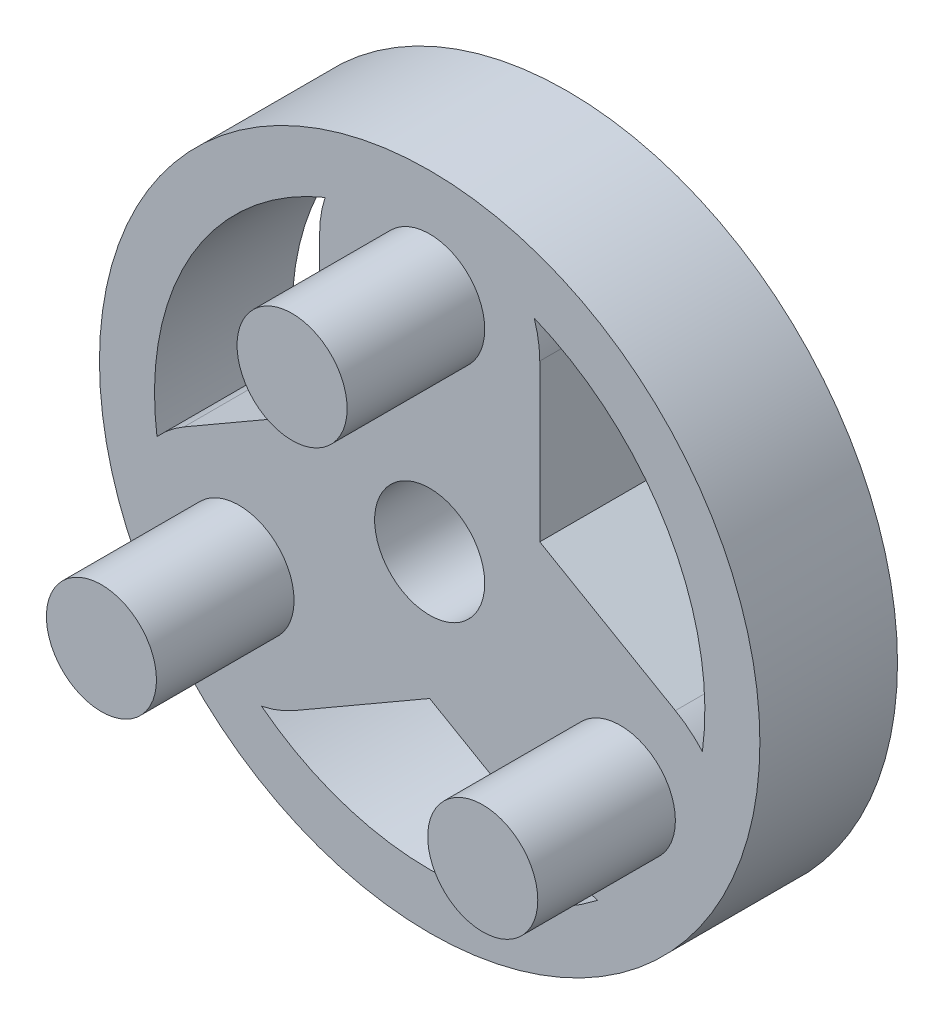
ISO-10303-21;
HEADER;
FILE_DESCRIPTION(('STEP AP214'),'2;1');
FILE_NAME('part.step','',(''),(''),'','','');
FILE_SCHEMA(('AUTOMOTIVE_DESIGN { 1 0 10303 214 1 1 1 1 }'));
ENDSEC;
DATA;
#1=APPLICATION_CONTEXT('core data for automotive mechanical design processes');
#2=APPLICATION_PROTOCOL_DEFINITION('international standard','automotive_design',2000,#1);
#3=PRODUCT_CONTEXT('',#1,'mechanical');
#4=PRODUCT('Part','Part','',(#3));
#5=PRODUCT_RELATED_PRODUCT_CATEGORY('part','',(#4));
#6=PRODUCT_DEFINITION_FORMATION('','',#4);
#7=PRODUCT_DEFINITION_CONTEXT('part definition',#1,'design');
#8=PRODUCT_DEFINITION('design','',#6,#7);
#9=PRODUCT_DEFINITION_SHAPE('','',#8);
#10=(LENGTH_UNIT() NAMED_UNIT(*) SI_UNIT(.MILLI.,.METRE.));
#11=(NAMED_UNIT(*) PLANE_ANGLE_UNIT() SI_UNIT($,.RADIAN.));
#12=(NAMED_UNIT(*) SI_UNIT($,.STERADIAN.) SOLID_ANGLE_UNIT());
#13=UNCERTAINTY_MEASURE_WITH_UNIT(LENGTH_MEASURE(1.E-05),#10,'distance_accuracy_value','');
#14=(GEOMETRIC_REPRESENTATION_CONTEXT(3) GLOBAL_UNCERTAINTY_ASSIGNED_CONTEXT((#13)) GLOBAL_UNIT_ASSIGNED_CONTEXT((#10,
#11,#12)) REPRESENTATION_CONTEXT('',''));
#15=CARTESIAN_POINT('',(0.,0.,0.));
#16=DIRECTION('',(0.,0.,1.));
#17=DIRECTION('',(1.,0.,0.));
#18=AXIS2_PLACEMENT_3D('',#15,#16,#17);
#19=CARTESIAN_POINT('',(0.,8.,5.));
#20=DIRECTION('',(0.,0.,-1.));
#21=DIRECTION('',(-1.,0.,0.));
#22=AXIS2_PLACEMENT_3D('',#19,#20,#21);
#23=CYLINDRICAL_SURFACE('',#22,4.);
#24=DIRECTION('',(0.,0.,1.));
#25=VECTOR('',#24,1.);
#26=CARTESIAN_POINT('',(-3.79967103839267,9.25,2.5));
#27=LINE('',#26,#25);
#28=CARTESIAN_POINT('',(-3.79967103839267,9.25,0.));
#29=VERTEX_POINT('',#28);
#30=CARTESIAN_POINT('',(-3.79967103839267,9.25,5.));
#31=VERTEX_POINT('',#30);
#32=EDGE_CURVE('E195',#29,#31,#27,.T.);
#33=ORIENTED_EDGE('',*,*,#32,.F.);
#34=CARTESIAN_POINT('',(0.,8.,0.));
#35=DIRECTION('',(0.,0.,1.));
#36=DIRECTION('',(1.,0.,0.));
#37=AXIS2_PLACEMENT_3D('',#34,#35,#36);
#38=CIRCLE('',#37,4.);
#39=CARTESIAN_POINT('',(-4.,8.,0.));
#40=VERTEX_POINT('',#39);
#41=EDGE_CURVE('E228',#29,#40,#38,.T.);
#42=ORIENTED_EDGE('',*,*,#41,.T.);
#43=DIRECTION('',(0.,0.,-1.));
#44=VECTOR('',#43,1.);
#45=CARTESIAN_POINT('',(-4.,8.,5.));
#46=LINE('',#45,#44);
#47=CARTESIAN_POINT('',(-4.,8.,5.));
#48=VERTEX_POINT('',#47);
#49=EDGE_CURVE('E11',#48,#40,#46,.T.);
#50=ORIENTED_EDGE('',*,*,#49,.F.);
#51=CARTESIAN_POINT('',(0.,8.,5.));
#52=DIRECTION('',(0.,0.,1.));
#53=DIRECTION('',(1.,0.,0.));
#54=AXIS2_PLACEMENT_3D('',#51,#52,#53);
#55=CIRCLE('',#54,4.);
#56=EDGE_CURVE('E200',#31,#48,#55,.T.);
#57=ORIENTED_EDGE('',*,*,#56,.F.);
#58=EDGE_LOOP('',(#33,#42,#50,#57));
#59=FACE_BOUND('',#58,.T.);
#60=ADVANCED_FACE('F35',(#59),#23,.T.);
#61=DIRECTION('',(0.,0.,1.));
#62=VECTOR('',#61,1.);
#63=CARTESIAN_POINT('',(3.79967103839267,9.25,2.5));
#64=LINE('',#63,#62);
#65=CARTESIAN_POINT('',(3.79967103839267,9.25,5.));
#66=VERTEX_POINT('',#65);
#67=CARTESIAN_POINT('',(3.79967103839267,9.25,0.));
#68=VERTEX_POINT('',#67);
#69=EDGE_CURVE('E164',#66,#68,#64,.F.);
#70=ORIENTED_EDGE('',*,*,#69,.F.);
#71=CARTESIAN_POINT('',(4.,8.,5.));
#72=VERTEX_POINT('',#71);
#73=EDGE_CURVE('E299',#72,#66,#55,.T.);
#74=ORIENTED_EDGE('',*,*,#73,.F.);
#75=DIRECTION('',(0.,0.,-1.));
#76=VECTOR('',#75,1.);
#77=CARTESIAN_POINT('',(4.,8.,5.));
#78=LINE('',#77,#76);
#79=CARTESIAN_POINT('',(4.,8.,0.));
#80=VERTEX_POINT('',#79);
#81=EDGE_CURVE('E224',#72,#80,#78,.T.);
#82=ORIENTED_EDGE('',*,*,#81,.T.);
#83=EDGE_CURVE('E225',#80,#68,#38,.T.);
#84=ORIENTED_EDGE('',*,*,#83,.T.);
#85=EDGE_LOOP('',(#70,#74,#82,#84));
#86=FACE_BOUND('',#85,.T.);
#87=ADVANCED_FACE('F306',(#86),#23,.T.);
#88=CARTESIAN_POINT('',(-6.92820323027555,-3.99999999999993,5.));
#89=DIRECTION('',(0.,0.,-1.));
#90=DIRECTION('',(-1.,0.,0.));
#91=AXIS2_PLACEMENT_3D('',#88,#89,#90);
#92=CYLINDRICAL_SURFACE('',#91,4.);
#93=DIRECTION('',(0.,0.,1.));
#94=VECTOR('',#93,1.);
#95=CARTESIAN_POINT('',(-6.1108994658098,-7.91561164527199,2.5));
#96=LINE('',#95,#94);
#97=CARTESIAN_POINT('',(-6.1108994658098,-7.91561164527199,0.));
#98=VERTEX_POINT('',#97);
#99=CARTESIAN_POINT('',(-6.1108994658098,-7.91561164527199,5.));
#100=VERTEX_POINT('',#99);
#101=EDGE_CURVE('E269',#98,#100,#96,.T.);
#102=ORIENTED_EDGE('',*,*,#101,.F.);
#103=CARTESIAN_POINT('',(-6.92820323027555,-3.99999999999993,0.));
#104=DIRECTION('',(0.,0.,1.));
#105=DIRECTION('',(1.,0.,0.));
#106=AXIS2_PLACEMENT_3D('',#103,#104,#105);
#107=CIRCLE('',#106,4.);
#108=CARTESIAN_POINT('',(-4.92820323027558,-7.46410161513771,0.));
#109=VERTEX_POINT('',#108);
#110=EDGE_CURVE('E232',#98,#109,#107,.T.);
#111=ORIENTED_EDGE('',*,*,#110,.T.);
#112=DIRECTION('',(0.,0.,-1.));
#113=VECTOR('',#112,1.);
#114=CARTESIAN_POINT('',(-4.92820323027558,-7.46410161513771,5.));
#115=LINE('',#114,#113);
#116=CARTESIAN_POINT('',(-4.92820323027558,-7.46410161513771,5.));
#117=VERTEX_POINT('',#116);
#118=EDGE_CURVE('E254',#117,#109,#115,.T.);
#119=ORIENTED_EDGE('',*,*,#118,.F.);
#120=CARTESIAN_POINT('',(-6.92820323027555,-3.99999999999993,5.));
#121=DIRECTION('',(0.,0.,1.));
#122=DIRECTION('',(1.,0.,0.));
#123=AXIS2_PLACEMENT_3D('',#120,#121,#122);
#124=CIRCLE('',#123,4.);
#125=EDGE_CURVE('E210',#100,#117,#124,.T.);
#126=ORIENTED_EDGE('',*,*,#125,.F.);
#127=EDGE_LOOP('',(#102,#111,#119,#126));
#128=FACE_BOUND('',#127,.T.);
#129=ADVANCED_FACE('F310',(#128),#92,.T.);
#130=DIRECTION('',(0.,0.,1.));
#131=VECTOR('',#130,1.);
#132=CARTESIAN_POINT('',(-9.9105705042024,-1.33438835472786,2.5));
#133=LINE('',#132,#131);
#134=CARTESIAN_POINT('',(-9.91057050420241,-1.33438835472786,5.));
#135=VERTEX_POINT('',#134);
#136=CARTESIAN_POINT('',(-9.91057050420241,-1.33438835472786,0.));
#137=VERTEX_POINT('',#136);
#138=EDGE_CURVE('E160',#135,#137,#133,.F.);
#139=ORIENTED_EDGE('',*,*,#138,.F.);
#140=CARTESIAN_POINT('',(-8.92820323027551,-0.53589838486216,5.));
#141=VERTEX_POINT('',#140);
#142=EDGE_CURVE('E203',#141,#135,#124,.T.);
#143=ORIENTED_EDGE('',*,*,#142,.F.);
#144=DIRECTION('',(0.,0.,-1.));
#145=VECTOR('',#144,1.);
#146=CARTESIAN_POINT('',(-8.92820323027551,-0.53589838486216,5.));
#147=LINE('',#146,#145);
#148=CARTESIAN_POINT('',(-8.92820323027551,-0.53589838486216,0.));
#149=VERTEX_POINT('',#148);
#150=EDGE_CURVE('E257',#141,#149,#147,.T.);
#151=ORIENTED_EDGE('',*,*,#150,.T.);
#152=EDGE_CURVE('E233',#149,#137,#107,.T.);
#153=ORIENTED_EDGE('',*,*,#152,.T.);
#154=EDGE_LOOP('',(#139,#143,#151,#153));
#155=FACE_BOUND('',#154,.T.);
#156=ADVANCED_FACE('F268',(#155),#92,.T.);
#157=CARTESIAN_POINT('',(6.92820323027549,-4.00000000000003,5.));
#158=DIRECTION('',(0.,0.,-1.));
#159=DIRECTION('',(-1.,0.,0.));
#160=AXIS2_PLACEMENT_3D('',#157,#158,#159);
#161=CYLINDRICAL_SURFACE('',#160,4.);
#162=DIRECTION('',(0.,0.,1.));
#163=VECTOR('',#162,1.);
#164=CARTESIAN_POINT('',(9.91057050420239,-1.334388354728,2.5));
#165=LINE('',#164,#163);
#166=CARTESIAN_POINT('',(9.91057050420238,-1.334388354728,0.));
#167=VERTEX_POINT('',#166);
#168=CARTESIAN_POINT('',(9.91057050420238,-1.334388354728,5.));
#169=VERTEX_POINT('',#168);
#170=EDGE_CURVE('E155',#167,#169,#165,.T.);
#171=ORIENTED_EDGE('',*,*,#170,.F.);
#172=CARTESIAN_POINT('',(6.92820323027549,-4.00000000000003,0.));
#173=DIRECTION('',(0.,0.,1.));
#174=DIRECTION('',(1.,0.,0.));
#175=AXIS2_PLACEMENT_3D('',#172,#173,#174);
#176=CIRCLE('',#175,4.);
#177=CARTESIAN_POINT('',(8.92820323027551,-0.535898384862288,0.));
#178=VERTEX_POINT('',#177);
#179=EDGE_CURVE('E143',#167,#178,#176,.T.);
#180=ORIENTED_EDGE('',*,*,#179,.T.);
#181=DIRECTION('',(0.,0.,-1.));
#182=VECTOR('',#181,1.);
#183=CARTESIAN_POINT('',(8.92820323027551,-0.535898384862288,5.));
#184=LINE('',#183,#182);
#185=CARTESIAN_POINT('',(8.92820323027551,-0.535898384862288,5.));
#186=VERTEX_POINT('',#185);
#187=EDGE_CURVE('E246',#186,#178,#184,.T.);
#188=ORIENTED_EDGE('',*,*,#187,.F.);
#189=CARTESIAN_POINT('',(6.92820323027549,-4.00000000000003,5.));
#190=DIRECTION('',(0.,0.,1.));
#191=DIRECTION('',(1.,0.,0.));
#192=AXIS2_PLACEMENT_3D('',#189,#190,#191);
#193=CIRCLE('',#192,4.);
#194=EDGE_CURVE('E49',#169,#186,#193,.T.);
#195=ORIENTED_EDGE('',*,*,#194,.F.);
#196=EDGE_LOOP('',(#171,#180,#188,#195));
#197=FACE_BOUND('',#196,.T.);
#198=ADVANCED_FACE('F156',(#197),#161,.T.);
#199=DIRECTION('',(0.,0.,1.));
#200=VECTOR('',#199,1.);
#201=CARTESIAN_POINT('',(6.11089946580969,-7.91561164527208,2.5));
#202=LINE('',#201,#200);
#203=CARTESIAN_POINT('',(6.11089946580969,-7.91561164527208,5.));
#204=VERTEX_POINT('',#203);
#205=CARTESIAN_POINT('',(6.11089946580969,-7.91561164527208,0.));
#206=VERTEX_POINT('',#205);
#207=EDGE_CURVE('E57',#204,#206,#202,.F.);
#208=ORIENTED_EDGE('',*,*,#207,.F.);
#209=CARTESIAN_POINT('',(4.92820323027547,-7.46410161513778,5.));
#210=VERTEX_POINT('',#209);
#211=EDGE_CURVE('E218',#210,#204,#193,.T.);
#212=ORIENTED_EDGE('',*,*,#211,.F.);
#213=DIRECTION('',(0.,0.,-1.));
#214=VECTOR('',#213,1.);
#215=CARTESIAN_POINT('',(4.92820323027547,-7.46410161513778,5.));
#216=LINE('',#215,#214);
#217=CARTESIAN_POINT('',(4.92820323027547,-7.46410161513778,0.));
#218=VERTEX_POINT('',#217);
#219=EDGE_CURVE('E248',#210,#218,#216,.T.);
#220=ORIENTED_EDGE('',*,*,#219,.T.);
#221=EDGE_CURVE('E152',#218,#206,#176,.T.);
#222=ORIENTED_EDGE('',*,*,#221,.T.);
#223=EDGE_LOOP('',(#208,#212,#220,#222));
#224=FACE_BOUND('',#223,.T.);
#225=ADVANCED_FACE('F342',(#224),#161,.T.);
#226=CARTESIAN_POINT('',(-4.,2.30940107675853,5.));
#227=DIRECTION('',(1.,0.,0.));
#228=DIRECTION('',(0.,0.,-1.));
#229=AXIS2_PLACEMENT_3D('',#226,#227,#228);
#230=PLANE('',#229);
#231=DIRECTION('',(0.,-1.,0.));
#232=VECTOR('',#231,1.);
#233=CARTESIAN_POINT('',(-4.,2.30940107675853,0.));
#234=LINE('',#233,#232);
#235=CARTESIAN_POINT('',(-4.,2.30940107675853,0.));
#236=VERTEX_POINT('',#235);
#237=EDGE_CURVE('E227',#40,#236,#234,.T.);
#238=ORIENTED_EDGE('',*,*,#237,.T.);
#239=DIRECTION('',(0.,0.,-1.));
#240=VECTOR('',#239,1.);
#241=CARTESIAN_POINT('',(-4.,2.30940107675853,5.));
#242=LINE('',#241,#240);
#243=CARTESIAN_POINT('',(-4.,2.30940107675853,5.));
#244=VERTEX_POINT('',#243);
#245=EDGE_CURVE('E42',#244,#236,#242,.T.);
#246=ORIENTED_EDGE('',*,*,#245,.F.);
#247=DIRECTION('',(0.,-1.,0.));
#248=VECTOR('',#247,1.);
#249=CARTESIAN_POINT('',(-4.,2.30940107675853,5.));
#250=LINE('',#249,#248);
#251=EDGE_CURVE('E301',#48,#244,#250,.T.);
#252=ORIENTED_EDGE('',*,*,#251,.F.);
#253=ORIENTED_EDGE('',*,*,#49,.T.);
#254=EDGE_LOOP('',(#238,#246,#252,#253));
#255=FACE_BOUND('',#254,.T.);
#256=ADVANCED_FACE('F303',(#255),#230,.F.);
#257=CARTESIAN_POINT('',(-4.,2.30940107675853,5.));
#258=DIRECTION('',(0.499999999999991,-0.866025403784444,0.));
#259=DIRECTION('',(0.866025403784444,0.499999999999991,0.));
#260=AXIS2_PLACEMENT_3D('',#257,#258,#259);
#261=PLANE('',#260);
#262=DIRECTION('',(-0.866025403784444,-0.499999999999991,0.));
#263=VECTOR('',#262,1.);
#264=CARTESIAN_POINT('',(-4.,2.30940107675853,0.));
#265=LINE('',#264,#263);
#266=EDGE_CURVE('E230',#236,#149,#265,.T.);
#267=ORIENTED_EDGE('',*,*,#266,.T.);
#268=ORIENTED_EDGE('',*,*,#150,.F.);
#269=DIRECTION('',(-0.866025403784444,-0.499999999999991,0.));
#270=VECTOR('',#269,1.);
#271=CARTESIAN_POINT('',(-4.,2.30940107675853,5.));
#272=LINE('',#271,#270);
#273=EDGE_CURVE('E205',#244,#141,#272,.T.);
#274=ORIENTED_EDGE('',*,*,#273,.F.);
#275=ORIENTED_EDGE('',*,*,#245,.T.);
#276=EDGE_LOOP('',(#267,#268,#274,#275));
#277=FACE_BOUND('',#276,.T.);
#278=ADVANCED_FACE('F262',(#277),#261,.F.);
#279=CARTESIAN_POINT('',(0.,-4.618802153517,5.));
#280=DIRECTION('',(-0.499999999999992,0.866025403784443,0.));
#281=DIRECTION('',(-0.866025403784443,-0.499999999999992,0.));
#282=AXIS2_PLACEMENT_3D('',#279,#280,#281);
#283=PLANE('',#282);
#284=DIRECTION('',(0.866025403784443,0.499999999999992,0.));
#285=VECTOR('',#284,1.);
#286=CARTESIAN_POINT('',(0.,-4.618802153517,0.));
#287=LINE('',#286,#285);
#288=CARTESIAN_POINT('',(0.,-4.618802153517,0.));
#289=VERTEX_POINT('',#288);
#290=EDGE_CURVE('E235',#109,#289,#287,.T.);
#291=ORIENTED_EDGE('',*,*,#290,.T.);
#292=DIRECTION('',(0.,0.,-1.));
#293=VECTOR('',#292,1.);
#294=CARTESIAN_POINT('',(0.,-4.618802153517,5.));
#295=LINE('',#294,#293);
#296=CARTESIAN_POINT('',(0.,-4.618802153517,5.));
#297=VERTEX_POINT('',#296);
#298=EDGE_CURVE('E251',#297,#289,#295,.T.);
#299=ORIENTED_EDGE('',*,*,#298,.F.);
#300=DIRECTION('',(0.866025403784443,0.499999999999992,0.));
#301=VECTOR('',#300,1.);
#302=CARTESIAN_POINT('',(0.,-4.618802153517,5.));
#303=LINE('',#302,#301);
#304=EDGE_CURVE('E209',#117,#297,#303,.T.);
#305=ORIENTED_EDGE('',*,*,#304,.F.);
#306=ORIENTED_EDGE('',*,*,#118,.T.);
#307=EDGE_LOOP('',(#291,#299,#305,#306));
#308=FACE_BOUND('',#307,.T.);
#309=ADVANCED_FACE('F336',(#308),#283,.F.);
#310=CARTESIAN_POINT('',(0.,-4.618802153517,5.));
#311=DIRECTION('',(0.500000000000004,0.866025403784436,0.));
#312=DIRECTION('',(-0.866025403784436,0.500000000000004,0.));
#313=AXIS2_PLACEMENT_3D('',#310,#311,#312);
#314=PLANE('',#313);
#315=DIRECTION('',(0.866025403784436,-0.500000000000004,0.));
#316=VECTOR('',#315,1.);
#317=CARTESIAN_POINT('',(0.,-4.618802153517,0.));
#318=LINE('',#317,#316);
#319=EDGE_CURVE('E153',#289,#218,#318,.T.);
#320=ORIENTED_EDGE('',*,*,#319,.T.);
#321=ORIENTED_EDGE('',*,*,#219,.F.);
#322=DIRECTION('',(0.866025403784436,-0.500000000000004,0.));
#323=VECTOR('',#322,1.);
#324=CARTESIAN_POINT('',(0.,-4.618802153517,5.));
#325=LINE('',#324,#323);
#326=EDGE_CURVE('E212',#297,#210,#325,.T.);
#327=ORIENTED_EDGE('',*,*,#326,.F.);
#328=ORIENTED_EDGE('',*,*,#298,.T.);
#329=EDGE_LOOP('',(#320,#321,#327,#328));
#330=FACE_BOUND('',#329,.T.);
#331=ADVANCED_FACE('F329',(#330),#314,.F.);
#332=CARTESIAN_POINT('',(4.,2.30940107675849,5.));
#333=DIRECTION('',(-0.500000000000004,-0.866025403784436,0.));
#334=DIRECTION('',(0.866025403784436,-0.500000000000004,0.));
#335=AXIS2_PLACEMENT_3D('',#332,#333,#334);
#336=PLANE('',#335);
#337=DIRECTION('',(-0.866025403784436,0.500000000000004,0.));
#338=VECTOR('',#337,1.);
#339=CARTESIAN_POINT('',(4.,2.30940107675849,0.));
#340=LINE('',#339,#338);
#341=CARTESIAN_POINT('',(4.,2.30940107675849,0.));
#342=VERTEX_POINT('',#341);
#343=EDGE_CURVE('E150',#178,#342,#340,.T.);
#344=ORIENTED_EDGE('',*,*,#343,.T.);
#345=DIRECTION('',(0.,0.,-1.));
#346=VECTOR('',#345,1.);
#347=CARTESIAN_POINT('',(4.,2.30940107675849,5.));
#348=LINE('',#347,#346);
#349=CARTESIAN_POINT('',(4.,2.30940107675849,5.));
#350=VERTEX_POINT('',#349);
#351=EDGE_CURVE('E243',#350,#342,#348,.T.);
#352=ORIENTED_EDGE('',*,*,#351,.F.);
#353=DIRECTION('',(-0.866025403784436,0.500000000000004,0.));
#354=VECTOR('',#353,1.);
#355=CARTESIAN_POINT('',(4.,2.30940107675849,5.));
#356=LINE('',#355,#354);
#357=EDGE_CURVE('E220',#186,#350,#356,.T.);
#358=ORIENTED_EDGE('',*,*,#357,.F.);
#359=ORIENTED_EDGE('',*,*,#187,.T.);
#360=EDGE_LOOP('',(#344,#352,#358,#359));
#361=FACE_BOUND('',#360,.T.);
#362=ADVANCED_FACE('F327',(#361),#336,.F.);
#363=CARTESIAN_POINT('',(4.,2.30940107675849,5.));
#364=DIRECTION('',(-1.,0.,0.));
#365=DIRECTION('',(0.,0.,1.));
#366=AXIS2_PLACEMENT_3D('',#363,#364,#365);
#367=PLANE('',#366);
#368=DIRECTION('',(0.,1.,0.));
#369=VECTOR('',#368,1.);
#370=CARTESIAN_POINT('',(4.,2.30940107675849,0.));
#371=LINE('',#370,#369);
#372=EDGE_CURVE('E239',#342,#80,#371,.T.);
#373=ORIENTED_EDGE('',*,*,#372,.T.);
#374=ORIENTED_EDGE('',*,*,#81,.F.);
#375=DIRECTION('',(0.,1.,0.));
#376=VECTOR('',#375,1.);
#377=CARTESIAN_POINT('',(4.,2.30940107675849,5.));
#378=LINE('',#377,#376);
#379=EDGE_CURVE('E222',#350,#72,#378,.T.);
#380=ORIENTED_EDGE('',*,*,#379,.F.);
#381=ORIENTED_EDGE('',*,*,#351,.T.);
#382=EDGE_LOOP('',(#373,#374,#380,#381));
#383=FACE_BOUND('',#382,.T.);
#384=ADVANCED_FACE('F325',(#383),#367,.F.);
#385=CARTESIAN_POINT('',(0.,8.,5.));
#386=DIRECTION('',(0.,0.,1.));
#387=DIRECTION('',(1.,0.,0.));
#388=AXIS2_PLACEMENT_3D('',#385,#386,#387);
#389=PLANE('',#388);
#390=CARTESIAN_POINT('',(0.,0.,5.));
#391=DIRECTION('',(0.,0.,1.));
#392=DIRECTION('',(1.,0.,0.));
#393=AXIS2_PLACEMENT_3D('',#390,#391,#392);
#394=CIRCLE('',#393,12.);
#395=CARTESIAN_POINT('',(12.,0.,5.));
#396=VERTEX_POINT('',#395);
#397=EDGE_CURVE('E166',#396,#396,#394,.T.);
#398=ORIENTED_EDGE('',*,*,#397,.T.);
#399=EDGE_LOOP('',(#398));
#400=FACE_BOUND('',#399,.T.);
#401=CARTESIAN_POINT('',(0.,0.,5.));
#402=DIRECTION('',(0.,0.,1.));
#403=DIRECTION('',(1.,0.,0.));
#404=AXIS2_PLACEMENT_3D('',#401,#402,#403);
#405=CIRCLE('',#404,10.);
#406=EDGE_CURVE('E171',#31,#135,#405,.T.);
#407=ORIENTED_EDGE('',*,*,#406,.F.);
#408=ORIENTED_EDGE('',*,*,#56,.T.);
#409=ORIENTED_EDGE('',*,*,#251,.T.);
#410=ORIENTED_EDGE('',*,*,#273,.T.);
#411=ORIENTED_EDGE('',*,*,#142,.T.);
#412=EDGE_LOOP('',(#407,#408,#409,#410,#411));
#413=FACE_BOUND('',#412,.T.);
#414=EDGE_CURVE('E185',#100,#204,#405,.T.);
#415=ORIENTED_EDGE('',*,*,#414,.F.);
#416=ORIENTED_EDGE('',*,*,#125,.T.);
#417=ORIENTED_EDGE('',*,*,#304,.T.);
#418=ORIENTED_EDGE('',*,*,#326,.T.);
#419=ORIENTED_EDGE('',*,*,#211,.T.);
#420=EDGE_LOOP('',(#415,#416,#417,#418,#419));
#421=FACE_BOUND('',#420,.T.);
#422=CARTESIAN_POINT('',(0.,8.,5.));
#423=DIRECTION('',(0.,0.,1.));
#424=DIRECTION('',(1.,0.,0.));
#425=AXIS2_PLACEMENT_3D('',#422,#423,#424);
#426=CIRCLE('',#425,2.);
#427=CARTESIAN_POINT('',(2.,8.,5.));
#428=VERTEX_POINT('',#427);
#429=EDGE_CURVE('E291',#428,#428,#426,.T.);
#430=ORIENTED_EDGE('',*,*,#429,.F.);
#431=EDGE_LOOP('',(#430));
#432=FACE_BOUND('',#431,.T.);
#433=CARTESIAN_POINT('',(-6.92820323027555,-3.99999999999993,5.));
#434=DIRECTION('',(0.,0.,1.));
#435=DIRECTION('',(1.,0.,0.));
#436=AXIS2_PLACEMENT_3D('',#433,#434,#435);
#437=CIRCLE('',#436,2.);
#438=CARTESIAN_POINT('',(-4.92820323027555,-3.99999999999993,5.));
#439=VERTEX_POINT('',#438);
#440=EDGE_CURVE('E281',#439,#439,#437,.T.);
#441=ORIENTED_EDGE('',*,*,#440,.F.);
#442=EDGE_LOOP('',(#441));
#443=FACE_BOUND('',#442,.T.);
#444=CARTESIAN_POINT('',(6.92820323027549,-4.00000000000003,5.));
#445=DIRECTION('',(0.,0.,1.));
#446=DIRECTION('',(1.,0.,0.));
#447=AXIS2_PLACEMENT_3D('',#444,#445,#446);
#448=CIRCLE('',#447,2.);
#449=CARTESIAN_POINT('',(8.92820323027549,-4.00000000000003,5.));
#450=VERTEX_POINT('',#449);
#451=EDGE_CURVE('E285',#450,#450,#448,.T.);
#452=ORIENTED_EDGE('',*,*,#451,.F.);
#453=EDGE_LOOP('',(#452));
#454=FACE_BOUND('',#453,.T.);
#455=ORIENTED_EDGE('',*,*,#73,.T.);
#456=EDGE_CURVE('E184',#169,#66,#405,.T.);
#457=ORIENTED_EDGE('',*,*,#456,.F.);
#458=ORIENTED_EDGE('',*,*,#194,.T.);
#459=ORIENTED_EDGE('',*,*,#357,.T.);
#460=ORIENTED_EDGE('',*,*,#379,.T.);
#461=EDGE_LOOP('',(#455,#457,#458,#459,#460));
#462=FACE_BOUND('',#461,.T.);
#463=CARTESIAN_POINT('',(0.,0.,5.));
#464=DIRECTION('',(0.,0.,1.));
#465=DIRECTION('',(1.,0.,0.));
#466=AXIS2_PLACEMENT_3D('',#463,#464,#465);
#467=CIRCLE('',#466,2.);
#468=CARTESIAN_POINT('',(2.,0.,5.));
#469=VERTEX_POINT('',#468);
#470=EDGE_CURVE('E278',#469,#469,#467,.T.);
#471=ORIENTED_EDGE('',*,*,#470,.F.);
#472=EDGE_LOOP('',(#471));
#473=FACE_BOUND('',#472,.T.);
#474=ADVANCED_FACE('F198',(#400,#413,#421,#432,#443,#454,#462,#473),#389,.T.);
#475=CARTESIAN_POINT('',(0.,8.,0.));
#476=DIRECTION('',(0.,0.,1.));
#477=DIRECTION('',(1.,0.,0.));
#478=AXIS2_PLACEMENT_3D('',#475,#476,#477);
#479=PLANE('',#478);
#480=CARTESIAN_POINT('',(0.,0.,0.));
#481=DIRECTION('',(0.,0.,1.));
#482=DIRECTION('',(1.,0.,0.));
#483=AXIS2_PLACEMENT_3D('',#480,#481,#482);
#484=CIRCLE('',#483,12.);
#485=CARTESIAN_POINT('',(12.,0.,0.));
#486=VERTEX_POINT('',#485);
#487=EDGE_CURVE('E175',#486,#486,#484,.F.);
#488=ORIENTED_EDGE('',*,*,#487,.T.);
#489=EDGE_LOOP('',(#488));
#490=FACE_BOUND('',#489,.T.);
#491=ORIENTED_EDGE('',*,*,#41,.F.);
#492=CARTESIAN_POINT('',(0.,0.,0.));
#493=DIRECTION('',(0.,0.,1.));
#494=DIRECTION('',(1.,0.,0.));
#495=AXIS2_PLACEMENT_3D('',#492,#493,#494);
#496=CIRCLE('',#495,10.);
#497=EDGE_CURVE('E165',#137,#29,#496,.F.);
#498=ORIENTED_EDGE('',*,*,#497,.F.);
#499=ORIENTED_EDGE('',*,*,#152,.F.);
#500=ORIENTED_EDGE('',*,*,#266,.F.);
#501=ORIENTED_EDGE('',*,*,#237,.F.);
#502=EDGE_LOOP('',(#491,#498,#499,#500,#501));
#503=FACE_BOUND('',#502,.T.);
#504=ORIENTED_EDGE('',*,*,#110,.F.);
#505=EDGE_CURVE('E168',#206,#98,#496,.F.);
#506=ORIENTED_EDGE('',*,*,#505,.F.);
#507=ORIENTED_EDGE('',*,*,#221,.F.);
#508=ORIENTED_EDGE('',*,*,#319,.F.);
#509=ORIENTED_EDGE('',*,*,#290,.F.);
#510=EDGE_LOOP('',(#504,#506,#507,#508,#509));
#511=FACE_BOUND('',#510,.T.);
#512=EDGE_CURVE('E148',#68,#167,#496,.F.);
#513=ORIENTED_EDGE('',*,*,#512,.F.);
#514=ORIENTED_EDGE('',*,*,#83,.F.);
#515=ORIENTED_EDGE('',*,*,#372,.F.);
#516=ORIENTED_EDGE('',*,*,#343,.F.);
#517=ORIENTED_EDGE('',*,*,#179,.F.);
#518=EDGE_LOOP('',(#513,#514,#515,#516,#517));
#519=FACE_BOUND('',#518,.T.);
#520=CARTESIAN_POINT('',(0.,0.,0.));
#521=DIRECTION('',(0.,0.,1.));
#522=DIRECTION('',(1.,0.,0.));
#523=AXIS2_PLACEMENT_3D('',#520,#521,#522);
#524=CIRCLE('',#523,2.);
#525=CARTESIAN_POINT('',(2.,0.,0.));
#526=VERTEX_POINT('',#525);
#527=EDGE_CURVE('E275',#526,#526,#524,.T.);
#528=ORIENTED_EDGE('',*,*,#527,.T.);
#529=EDGE_LOOP('',(#528));
#530=FACE_BOUND('',#529,.T.);
#531=ADVANCED_FACE('F144',(#490,#503,#511,#519,#530),#479,.F.);
#532=CARTESIAN_POINT('',(0.,8.,10.));
#533=DIRECTION('',(0.,0.,-1.));
#534=DIRECTION('',(-1.,0.,0.));
#535=AXIS2_PLACEMENT_3D('',#532,#533,#534);
#536=CYLINDRICAL_SURFACE('',#535,2.);
#537=CARTESIAN_POINT('',(0.,8.,10.));
#538=DIRECTION('',(0.,0.,1.));
#539=DIRECTION('',(1.,0.,0.));
#540=AXIS2_PLACEMENT_3D('',#537,#538,#539);
#541=CIRCLE('',#540,2.);
#542=CARTESIAN_POINT('',(2.,8.,10.));
#543=VERTEX_POINT('',#542);
#544=EDGE_CURVE('E294',#543,#543,#541,.T.);
#545=ORIENTED_EDGE('',*,*,#544,.F.);
#546=EDGE_LOOP('',(#545));
#547=FACE_BOUND('',#546,.T.);
#548=ORIENTED_EDGE('',*,*,#429,.T.);
#549=EDGE_LOOP('',(#548));
#550=FACE_BOUND('',#549,.T.);
#551=ADVANCED_FACE('F425',(#547,#550),#536,.T.);
#552=CARTESIAN_POINT('',(0.,8.,10.));
#553=DIRECTION('',(0.,0.,1.));
#554=DIRECTION('',(1.,0.,0.));
#555=AXIS2_PLACEMENT_3D('',#552,#553,#554);
#556=PLANE('',#555);
#557=ORIENTED_EDGE('',*,*,#544,.T.);
#558=EDGE_LOOP('',(#557));
#559=FACE_BOUND('',#558,.T.);
#560=ADVANCED_FACE('F420',(#559),#556,.T.);
#561=CARTESIAN_POINT('',(6.92820323027549,-4.00000000000003,10.));
#562=DIRECTION('',(0.,0.,-1.));
#563=DIRECTION('',(-1.,0.,0.));
#564=AXIS2_PLACEMENT_3D('',#561,#562,#563);
#565=CYLINDRICAL_SURFACE('',#564,2.);
#566=CARTESIAN_POINT('',(6.92820323027549,-4.00000000000003,10.));
#567=DIRECTION('',(0.,0.,1.));
#568=DIRECTION('',(1.,0.,0.));
#569=AXIS2_PLACEMENT_3D('',#566,#567,#568);
#570=CIRCLE('',#569,2.);
#571=CARTESIAN_POINT('',(8.92820323027549,-4.00000000000003,10.));
#572=VERTEX_POINT('',#571);
#573=EDGE_CURVE('E288',#572,#572,#570,.T.);
#574=ORIENTED_EDGE('',*,*,#573,.F.);
#575=EDGE_LOOP('',(#574));
#576=FACE_BOUND('',#575,.T.);
#577=ORIENTED_EDGE('',*,*,#451,.T.);
#578=EDGE_LOOP('',(#577));
#579=FACE_BOUND('',#578,.T.);
#580=ADVANCED_FACE('F412',(#576,#579),#565,.T.);
#581=CARTESIAN_POINT('',(6.92820323027549,-4.00000000000003,10.));
#582=DIRECTION('',(0.,0.,1.));
#583=DIRECTION('',(1.,0.,0.));
#584=AXIS2_PLACEMENT_3D('',#581,#582,#583);
#585=PLANE('',#584);
#586=ORIENTED_EDGE('',*,*,#573,.T.);
#587=EDGE_LOOP('',(#586));
#588=FACE_BOUND('',#587,.T.);
#589=ADVANCED_FACE('F407',(#588),#585,.T.);
#590=CARTESIAN_POINT('',(-6.92820323027555,-3.99999999999993,10.));
#591=DIRECTION('',(0.,0.,-1.));
#592=DIRECTION('',(-1.,0.,0.));
#593=AXIS2_PLACEMENT_3D('',#590,#591,#592);
#594=CYLINDRICAL_SURFACE('',#593,2.);
#595=CARTESIAN_POINT('',(-6.92820323027555,-3.99999999999993,10.));
#596=DIRECTION('',(0.,0.,1.));
#597=DIRECTION('',(1.,0.,0.));
#598=AXIS2_PLACEMENT_3D('',#595,#596,#597);
#599=CIRCLE('',#598,2.);
#600=CARTESIAN_POINT('',(-4.92820323027555,-3.99999999999993,10.));
#601=VERTEX_POINT('',#600);
#602=EDGE_CURVE('E282',#601,#601,#599,.T.);
#603=ORIENTED_EDGE('',*,*,#602,.F.);
#604=EDGE_LOOP('',(#603));
#605=FACE_BOUND('',#604,.T.);
#606=ORIENTED_EDGE('',*,*,#440,.T.);
#607=EDGE_LOOP('',(#606));
#608=FACE_BOUND('',#607,.T.);
#609=ADVANCED_FACE('F399',(#605,#608),#594,.T.);
#610=CARTESIAN_POINT('',(-6.92820323027555,-3.99999999999993,10.));
#611=DIRECTION('',(0.,0.,1.));
#612=DIRECTION('',(1.,0.,0.));
#613=AXIS2_PLACEMENT_3D('',#610,#611,#612);
#614=PLANE('',#613);
#615=ORIENTED_EDGE('',*,*,#602,.T.);
#616=EDGE_LOOP('',(#615));
#617=FACE_BOUND('',#616,.T.);
#618=ADVANCED_FACE('F388',(#617),#614,.T.);
#619=CARTESIAN_POINT('',(0.,0.,0.));
#620=DIRECTION('',(0.,0.,1.));
#621=DIRECTION('',(1.,0.,0.));
#622=AXIS2_PLACEMENT_3D('',#619,#620,#621);
#623=CYLINDRICAL_SURFACE('',#622,2.);
#624=ORIENTED_EDGE('',*,*,#470,.T.);
#625=EDGE_LOOP('',(#624));
#626=FACE_BOUND('',#625,.T.);
#627=ORIENTED_EDGE('',*,*,#527,.F.);
#628=EDGE_LOOP('',(#627));
#629=FACE_BOUND('',#628,.T.);
#630=ADVANCED_FACE('F382',(#626,#629),#623,.F.);
#631=CARTESIAN_POINT('',(0.,0.,-33.9411254969543));
#632=DIRECTION('',(0.,0.,1.));
#633=DIRECTION('',(1.,0.,0.));
#634=AXIS2_PLACEMENT_3D('',#631,#632,#633);
#635=CYLINDRICAL_SURFACE('',#634,12.);
#636=ORIENTED_EDGE('',*,*,#397,.F.);
#637=EDGE_LOOP('',(#636));
#638=FACE_BOUND('',#637,.T.);
#639=ORIENTED_EDGE('',*,*,#487,.F.);
#640=EDGE_LOOP('',(#639));
#641=FACE_BOUND('',#640,.T.);
#642=ADVANCED_FACE('F387',(#638,#641),#635,.T.);
#643=CARTESIAN_POINT('',(0.,0.,-33.9411254969543));
#644=DIRECTION('',(0.,0.,1.));
#645=DIRECTION('',(1.,0.,0.));
#646=AXIS2_PLACEMENT_3D('',#643,#644,#645);
#647=CYLINDRICAL_SURFACE('',#646,10.);
#648=ORIENTED_EDGE('',*,*,#497,.T.);
#649=ORIENTED_EDGE('',*,*,#32,.T.);
#650=ORIENTED_EDGE('',*,*,#406,.T.);
#651=ORIENTED_EDGE('',*,*,#138,.T.);
#652=EDGE_LOOP('',(#648,#649,#650,#651));
#653=FACE_BOUND('',#652,.T.);
#654=ADVANCED_FACE('F192',(#653),#647,.F.);
#655=ORIENTED_EDGE('',*,*,#456,.T.);
#656=ORIENTED_EDGE('',*,*,#69,.T.);
#657=ORIENTED_EDGE('',*,*,#512,.T.);
#658=ORIENTED_EDGE('',*,*,#170,.T.);
#659=EDGE_LOOP('',(#655,#656,#657,#658));
#660=FACE_BOUND('',#659,.T.);
#661=ADVANCED_FACE('F163',(#660),#647,.F.);
#662=ORIENTED_EDGE('',*,*,#505,.T.);
#663=ORIENTED_EDGE('',*,*,#101,.T.);
#664=ORIENTED_EDGE('',*,*,#414,.T.);
#665=ORIENTED_EDGE('',*,*,#207,.T.);
#666=EDGE_LOOP('',(#662,#663,#664,#665));
#667=FACE_BOUND('',#666,.T.);
#668=ADVANCED_FACE('F511',(#667),#647,.F.);
#669=CLOSED_SHELL('',(#60,#87,#129,#156,#198,#225,#256,#278,#309,#331,#362,#384,#474,#531,#551,
#560,#580,#589,#609,#618,#630,#642,#654,#661,#668));
#670=MANIFOLD_SOLID_BREP('B2',#669);
#671=ADVANCED_BREP_SHAPE_REPRESENTATION('',(#18,#670),#14);
#672=SHAPE_DEFINITION_REPRESENTATION(#9,#671);
ENDSEC;
END-ISO-10303-21;
